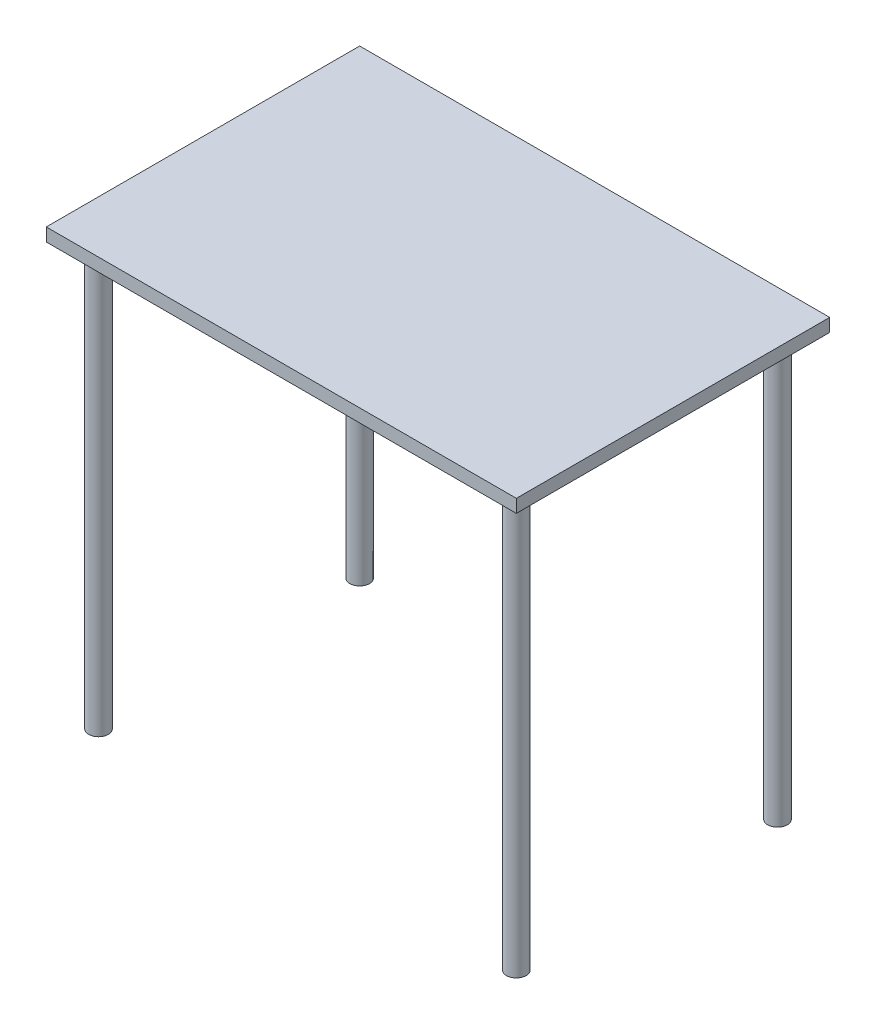
ISO-10303-21;
HEADER;
FILE_DESCRIPTION(('STEP AP214'),'2;1');
FILE_NAME('part.step','',(''),(''),'','','');
FILE_SCHEMA(('AUTOMOTIVE_DESIGN { 1 0 10303 214 1 1 1 1 }'));
ENDSEC;
DATA;
#1=APPLICATION_CONTEXT('core data for automotive mechanical design processes');
#2=APPLICATION_PROTOCOL_DEFINITION('international standard','automotive_design',2000,#1);
#3=PRODUCT_CONTEXT('',#1,'mechanical');
#4=PRODUCT('Part','Part','',(#3));
#5=PRODUCT_RELATED_PRODUCT_CATEGORY('part','',(#4));
#6=PRODUCT_DEFINITION_FORMATION('','',#4);
#7=PRODUCT_DEFINITION_CONTEXT('part definition',#1,'design');
#8=PRODUCT_DEFINITION('design','',#6,#7);
#9=PRODUCT_DEFINITION_SHAPE('','',#8);
#10=(LENGTH_UNIT() NAMED_UNIT(*) SI_UNIT(.MILLI.,.METRE.));
#11=(NAMED_UNIT(*) PLANE_ANGLE_UNIT() SI_UNIT($,.RADIAN.));
#12=(NAMED_UNIT(*) SI_UNIT($,.STERADIAN.) SOLID_ANGLE_UNIT());
#13=UNCERTAINTY_MEASURE_WITH_UNIT(LENGTH_MEASURE(1.E-05),#10,'distance_accuracy_value','');
#14=(GEOMETRIC_REPRESENTATION_CONTEXT(3) GLOBAL_UNCERTAINTY_ASSIGNED_CONTEXT((#13)) GLOBAL_UNIT_ASSIGNED_CONTEXT((#10,
#11,#12)) REPRESENTATION_CONTEXT('',''));
#15=CARTESIAN_POINT('',(0.,0.,0.));
#16=DIRECTION('',(0.,0.,1.));
#17=DIRECTION('',(1.,0.,0.));
#18=AXIS2_PLACEMENT_3D('',#15,#16,#17);
#19=CARTESIAN_POINT('',(0.,25.4,0.));
#20=DIRECTION('',(1.,0.,0.));
#21=DIRECTION('',(0.,0.,-1.));
#22=AXIS2_PLACEMENT_3D('',#19,#20,#21);
#23=PLANE('',#22);
#24=DIRECTION('',(0.,0.,1.));
#25=VECTOR('',#24,1.);
#26=CARTESIAN_POINT('',(0.,0.,0.));
#27=LINE('',#26,#25);
#28=CARTESIAN_POINT('',(0.,0.,-609.6));
#29=VERTEX_POINT('',#28);
#30=CARTESIAN_POINT('',(0.,0.,0.));
#31=VERTEX_POINT('',#30);
#32=EDGE_CURVE('E97',#29,#31,#27,.T.);
#33=ORIENTED_EDGE('',*,*,#32,.T.);
#34=DIRECTION('',(0.,-1.,0.));
#35=VECTOR('',#34,1.);
#36=CARTESIAN_POINT('',(0.,25.4,0.));
#37=LINE('',#36,#35);
#38=CARTESIAN_POINT('',(0.,25.4,0.));
#39=VERTEX_POINT('',#38);
#40=EDGE_CURVE('E12',#39,#31,#37,.T.);
#41=ORIENTED_EDGE('',*,*,#40,.F.);
#42=DIRECTION('',(0.,0.,1.));
#43=VECTOR('',#42,1.);
#44=CARTESIAN_POINT('',(0.,25.4,0.));
#45=LINE('',#44,#43);
#46=CARTESIAN_POINT('',(0.,25.4,-609.6));
#47=VERTEX_POINT('',#46);
#48=EDGE_CURVE('E85',#47,#39,#45,.T.);
#49=ORIENTED_EDGE('',*,*,#48,.F.);
#50=DIRECTION('',(0.,-1.,0.));
#51=VECTOR('',#50,1.);
#52=CARTESIAN_POINT('',(0.,25.4,-609.6));
#53=LINE('',#52,#51);
#54=EDGE_CURVE('E93',#47,#29,#53,.T.);
#55=ORIENTED_EDGE('',*,*,#54,.T.);
#56=EDGE_LOOP('',(#33,#41,#49,#55));
#57=FACE_BOUND('',#56,.T.);
#58=ADVANCED_FACE('F34',(#57),#23,.F.);
#59=CARTESIAN_POINT('',(0.,25.4,0.));
#60=DIRECTION('',(0.,0.,-1.));
#61=DIRECTION('',(-1.,0.,0.));
#62=AXIS2_PLACEMENT_3D('',#59,#60,#61);
#63=PLANE('',#62);
#64=DIRECTION('',(1.,0.,0.));
#65=VECTOR('',#64,1.);
#66=CARTESIAN_POINT('',(0.,0.,0.));
#67=LINE('',#66,#65);
#68=CARTESIAN_POINT('',(914.4,0.,0.));
#69=VERTEX_POINT('',#68);
#70=EDGE_CURVE('E89',#31,#69,#67,.T.);
#71=ORIENTED_EDGE('',*,*,#70,.T.);
#72=DIRECTION('',(0.,-1.,0.));
#73=VECTOR('',#72,1.);
#74=CARTESIAN_POINT('',(914.4,25.4,0.));
#75=LINE('',#74,#73);
#76=CARTESIAN_POINT('',(914.4,25.4,0.));
#77=VERTEX_POINT('',#76);
#78=EDGE_CURVE('E42',#77,#69,#75,.T.);
#79=ORIENTED_EDGE('',*,*,#78,.F.);
#80=DIRECTION('',(1.,0.,0.));
#81=VECTOR('',#80,1.);
#82=CARTESIAN_POINT('',(0.,25.4,0.));
#83=LINE('',#82,#81);
#84=EDGE_CURVE('E80',#39,#77,#83,.T.);
#85=ORIENTED_EDGE('',*,*,#84,.F.);
#86=ORIENTED_EDGE('',*,*,#40,.T.);
#87=EDGE_LOOP('',(#71,#79,#85,#86));
#88=FACE_BOUND('',#87,.T.);
#89=ADVANCED_FACE('F88',(#88),#63,.F.);
#90=CARTESIAN_POINT('',(914.4,25.4,0.));
#91=DIRECTION('',(-1.,0.,0.));
#92=DIRECTION('',(0.,0.,1.));
#93=AXIS2_PLACEMENT_3D('',#90,#91,#92);
#94=PLANE('',#93);
#95=DIRECTION('',(0.,0.,-1.));
#96=VECTOR('',#95,1.);
#97=CARTESIAN_POINT('',(914.4,0.,0.));
#98=LINE('',#97,#96);
#99=CARTESIAN_POINT('',(914.4,0.,-609.6));
#100=VERTEX_POINT('',#99);
#101=EDGE_CURVE('E67',#69,#100,#98,.T.);
#102=ORIENTED_EDGE('',*,*,#101,.T.);
#103=DIRECTION('',(0.,-1.,0.));
#104=VECTOR('',#103,1.);
#105=CARTESIAN_POINT('',(914.4,25.4,-609.6));
#106=LINE('',#105,#104);
#107=CARTESIAN_POINT('',(914.4,25.4,-609.6));
#108=VERTEX_POINT('',#107);
#109=EDGE_CURVE('E90',#108,#100,#106,.T.);
#110=ORIENTED_EDGE('',*,*,#109,.F.);
#111=DIRECTION('',(0.,0.,-1.));
#112=VECTOR('',#111,1.);
#113=CARTESIAN_POINT('',(914.4,25.4,0.));
#114=LINE('',#113,#112);
#115=EDGE_CURVE('E83',#77,#108,#114,.T.);
#116=ORIENTED_EDGE('',*,*,#115,.F.);
#117=ORIENTED_EDGE('',*,*,#78,.T.);
#118=EDGE_LOOP('',(#102,#110,#116,#117));
#119=FACE_BOUND('',#118,.T.);
#120=ADVANCED_FACE('F91',(#119),#94,.F.);
#121=CARTESIAN_POINT('',(0.,25.4,-609.6));
#122=DIRECTION('',(0.,0.,1.));
#123=DIRECTION('',(1.,0.,0.));
#124=AXIS2_PLACEMENT_3D('',#121,#122,#123);
#125=PLANE('',#124);
#126=DIRECTION('',(-1.,0.,0.));
#127=VECTOR('',#126,1.);
#128=CARTESIAN_POINT('',(0.,0.,-609.6));
#129=LINE('',#128,#127);
#130=EDGE_CURVE('E73',#100,#29,#129,.T.);
#131=ORIENTED_EDGE('',*,*,#130,.T.);
#132=ORIENTED_EDGE('',*,*,#54,.F.);
#133=DIRECTION('',(-1.,0.,0.));
#134=VECTOR('',#133,1.);
#135=CARTESIAN_POINT('',(0.,25.4,-609.6));
#136=LINE('',#135,#134);
#137=EDGE_CURVE('E50',#108,#47,#136,.T.);
#138=ORIENTED_EDGE('',*,*,#137,.F.);
#139=ORIENTED_EDGE('',*,*,#109,.T.);
#140=EDGE_LOOP('',(#131,#132,#138,#139));
#141=FACE_BOUND('',#140,.T.);
#142=ADVANCED_FACE('F105',(#141),#125,.F.);
#143=CARTESIAN_POINT('',(0.,25.4,0.));
#144=DIRECTION('',(0.,-1.,0.));
#145=DIRECTION('',(0.,0.,-1.));
#146=AXIS2_PLACEMENT_3D('',#143,#144,#145);
#147=PLANE('',#146);
#148=ORIENTED_EDGE('',*,*,#48,.T.);
#149=ORIENTED_EDGE('',*,*,#84,.T.);
#150=ORIENTED_EDGE('',*,*,#115,.T.);
#151=ORIENTED_EDGE('',*,*,#137,.T.);
#152=EDGE_LOOP('',(#148,#149,#150,#151));
#153=FACE_BOUND('',#152,.T.);
#154=ADVANCED_FACE('F81',(#153),#147,.F.);
#155=CARTESIAN_POINT('',(0.,0.,0.));
#156=DIRECTION('',(0.,-1.,0.));
#157=DIRECTION('',(0.,0.,-1.));
#158=AXIS2_PLACEMENT_3D('',#155,#156,#157);
#159=PLANE('',#158);
#160=CARTESIAN_POINT('',(863.6,0.,-558.8));
#161=DIRECTION('',(0.,-1.,0.));
#162=DIRECTION('',(0.,0.,-1.));
#163=AXIS2_PLACEMENT_3D('',#160,#161,#162);
#164=CIRCLE('',#163,19.05);
#165=CARTESIAN_POINT('',(863.6,0.,-577.85));
#166=VERTEX_POINT('',#165);
#167=EDGE_CURVE('E131',#166,#166,#164,.T.);
#168=ORIENTED_EDGE('',*,*,#167,.F.);
#169=EDGE_LOOP('',(#168));
#170=FACE_BOUND('',#169,.T.);
#171=CARTESIAN_POINT('',(50.8000000000001,0.,-558.8));
#172=DIRECTION('',(0.,-1.,0.));
#173=DIRECTION('',(0.,0.,-1.));
#174=AXIS2_PLACEMENT_3D('',#171,#172,#173);
#175=CIRCLE('',#174,19.05);
#176=CARTESIAN_POINT('',(50.8000000000001,0.,-577.85));
#177=VERTEX_POINT('',#176);
#178=EDGE_CURVE('E125',#177,#177,#175,.T.);
#179=ORIENTED_EDGE('',*,*,#178,.F.);
#180=EDGE_LOOP('',(#179));
#181=FACE_BOUND('',#180,.T.);
#182=CARTESIAN_POINT('',(863.6,0.,-50.7999999999999));
#183=DIRECTION('',(0.,-1.,0.));
#184=DIRECTION('',(0.,0.,-1.));
#185=AXIS2_PLACEMENT_3D('',#182,#183,#184);
#186=CIRCLE('',#185,19.05);
#187=CARTESIAN_POINT('',(863.6,0.,-69.8499999999999));
#188=VERTEX_POINT('',#187);
#189=EDGE_CURVE('E119',#188,#188,#186,.T.);
#190=ORIENTED_EDGE('',*,*,#189,.F.);
#191=EDGE_LOOP('',(#190));
#192=FACE_BOUND('',#191,.T.);
#193=CARTESIAN_POINT('',(50.8,0.,-50.8));
#194=DIRECTION('',(0.,-1.,0.));
#195=DIRECTION('',(0.,0.,-1.));
#196=AXIS2_PLACEMENT_3D('',#193,#194,#195);
#197=CIRCLE('',#196,19.0500000000001);
#198=CARTESIAN_POINT('',(50.8,0.,-69.8500000000001));
#199=VERTEX_POINT('',#198);
#200=EDGE_CURVE('E113',#199,#199,#197,.T.);
#201=ORIENTED_EDGE('',*,*,#200,.F.);
#202=EDGE_LOOP('',(#201));
#203=FACE_BOUND('',#202,.T.);
#204=ORIENTED_EDGE('',*,*,#32,.F.);
#205=ORIENTED_EDGE('',*,*,#130,.F.);
#206=ORIENTED_EDGE('',*,*,#101,.F.);
#207=ORIENTED_EDGE('',*,*,#70,.F.);
#208=EDGE_LOOP('',(#204,#205,#206,#207));
#209=FACE_BOUND('',#208,.T.);
#210=ADVANCED_FACE('F108',(#170,#181,#192,#203,#209),#159,.T.);
#211=CARTESIAN_POINT('',(50.8,-1719.41033672642,-50.8));
#212=DIRECTION('',(0.,1.,0.));
#213=DIRECTION('',(0.,0.,1.));
#214=AXIS2_PLACEMENT_3D('',#211,#212,#213);
#215=CYLINDRICAL_SURFACE('',#214,19.0500000000001);
#216=ORIENTED_EDGE('',*,*,#200,.T.);
#217=EDGE_LOOP('',(#216));
#218=FACE_BOUND('',#217,.T.);
#219=CARTESIAN_POINT('',(50.8,-820.0644,-50.8));
#220=DIRECTION('',(0.,-1.,0.));
#221=DIRECTION('',(0.,0.,-1.));
#222=AXIS2_PLACEMENT_3D('',#219,#220,#221);
#223=CIRCLE('',#222,19.0500000000001);
#224=CARTESIAN_POINT('',(50.8,-820.0644,-69.8500000000001));
#225=VERTEX_POINT('',#224);
#226=EDGE_CURVE('E100',#225,#225,#223,.T.);
#227=ORIENTED_EDGE('',*,*,#226,.F.);
#228=EDGE_LOOP('',(#227));
#229=FACE_BOUND('',#228,.T.);
#230=ADVANCED_FACE('F140',(#218,#229),#215,.T.);
#231=CARTESIAN_POINT('',(0.,-820.0644,0.));
#232=DIRECTION('',(0.,-1.,0.));
#233=DIRECTION('',(0.,0.,-1.));
#234=AXIS2_PLACEMENT_3D('',#231,#232,#233);
#235=PLANE('',#234);
#236=ORIENTED_EDGE('',*,*,#226,.T.);
#237=EDGE_LOOP('',(#236));
#238=FACE_BOUND('',#237,.T.);
#239=ADVANCED_FACE('F150',(#238),#235,.T.);
#240=CARTESIAN_POINT('',(863.6,-1719.41033672642,-50.7999999999999));
#241=DIRECTION('',(0.,1.,0.));
#242=DIRECTION('',(0.,0.,1.));
#243=AXIS2_PLACEMENT_3D('',#240,#241,#242);
#244=CYLINDRICAL_SURFACE('',#243,19.05);
#245=ORIENTED_EDGE('',*,*,#189,.T.);
#246=EDGE_LOOP('',(#245));
#247=FACE_BOUND('',#246,.T.);
#248=CARTESIAN_POINT('',(863.6,-820.0644,-50.7999999999999));
#249=DIRECTION('',(0.,-1.,0.));
#250=DIRECTION('',(0.,0.,-1.));
#251=AXIS2_PLACEMENT_3D('',#248,#249,#250);
#252=CIRCLE('',#251,19.05);
#253=CARTESIAN_POINT('',(863.6,-820.0644,-69.8499999999999));
#254=VERTEX_POINT('',#253);
#255=EDGE_CURVE('E116',#254,#254,#252,.T.);
#256=ORIENTED_EDGE('',*,*,#255,.F.);
#257=EDGE_LOOP('',(#256));
#258=FACE_BOUND('',#257,.T.);
#259=ADVANCED_FACE('F155',(#247,#258),#244,.T.);
#260=CARTESIAN_POINT('',(0.,-820.0644,0.));
#261=DIRECTION('',(0.,-1.,0.));
#262=DIRECTION('',(0.,0.,-1.));
#263=AXIS2_PLACEMENT_3D('',#260,#261,#262);
#264=PLANE('',#263);
#265=ORIENTED_EDGE('',*,*,#255,.T.);
#266=EDGE_LOOP('',(#265));
#267=FACE_BOUND('',#266,.T.);
#268=ADVANCED_FACE('F160',(#267),#264,.T.);
#269=CARTESIAN_POINT('',(50.8000000000001,-1719.41033672642,-558.8));
#270=DIRECTION('',(0.,1.,0.));
#271=DIRECTION('',(0.,0.,1.));
#272=AXIS2_PLACEMENT_3D('',#269,#270,#271);
#273=CYLINDRICAL_SURFACE('',#272,19.05);
#274=ORIENTED_EDGE('',*,*,#178,.T.);
#275=EDGE_LOOP('',(#274));
#276=FACE_BOUND('',#275,.T.);
#277=CARTESIAN_POINT('',(50.8000000000001,-820.0644,-558.8));
#278=DIRECTION('',(0.,-1.,0.));
#279=DIRECTION('',(0.,0.,-1.));
#280=AXIS2_PLACEMENT_3D('',#277,#278,#279);
#281=CIRCLE('',#280,19.05);
#282=CARTESIAN_POINT('',(50.8000000000001,-820.0644,-577.85));
#283=VERTEX_POINT('',#282);
#284=EDGE_CURVE('E122',#283,#283,#281,.T.);
#285=ORIENTED_EDGE('',*,*,#284,.F.);
#286=EDGE_LOOP('',(#285));
#287=FACE_BOUND('',#286,.T.);
#288=ADVANCED_FACE('F206',(#276,#287),#273,.T.);
#289=CARTESIAN_POINT('',(0.,-820.0644,0.));
#290=DIRECTION('',(0.,-1.,0.));
#291=DIRECTION('',(0.,0.,-1.));
#292=AXIS2_PLACEMENT_3D('',#289,#290,#291);
#293=PLANE('',#292);
#294=ORIENTED_EDGE('',*,*,#284,.T.);
#295=EDGE_LOOP('',(#294));
#296=FACE_BOUND('',#295,.T.);
#297=ADVANCED_FACE('F216',(#296),#293,.T.);
#298=CARTESIAN_POINT('',(863.6,-1719.41033672642,-558.8));
#299=DIRECTION('',(0.,1.,0.));
#300=DIRECTION('',(0.,0.,1.));
#301=AXIS2_PLACEMENT_3D('',#298,#299,#300);
#302=CYLINDRICAL_SURFACE('',#301,19.05);
#303=ORIENTED_EDGE('',*,*,#167,.T.);
#304=EDGE_LOOP('',(#303));
#305=FACE_BOUND('',#304,.T.);
#306=CARTESIAN_POINT('',(863.6,-820.0644,-558.8));
#307=DIRECTION('',(0.,-1.,0.));
#308=DIRECTION('',(0.,0.,-1.));
#309=AXIS2_PLACEMENT_3D('',#306,#307,#308);
#310=CIRCLE('',#309,19.05);
#311=CARTESIAN_POINT('',(863.6,-820.0644,-577.85));
#312=VERTEX_POINT('',#311);
#313=EDGE_CURVE('E128',#312,#312,#310,.T.);
#314=ORIENTED_EDGE('',*,*,#313,.F.);
#315=EDGE_LOOP('',(#314));
#316=FACE_BOUND('',#315,.T.);
#317=ADVANCED_FACE('F135',(#305,#316),#302,.T.);
#318=CARTESIAN_POINT('',(0.,-820.0644,0.));
#319=DIRECTION('',(0.,-1.,0.));
#320=DIRECTION('',(0.,0.,-1.));
#321=AXIS2_PLACEMENT_3D('',#318,#319,#320);
#322=PLANE('',#321);
#323=ORIENTED_EDGE('',*,*,#313,.T.);
#324=EDGE_LOOP('',(#323));
#325=FACE_BOUND('',#324,.T.);
#326=ADVANCED_FACE('F235',(#325),#322,.T.);
#327=CLOSED_SHELL('',(#58,#89,#120,#142,#154,#210,#230,#239,#259,#268,#288,#297,#317,#326));
#328=MANIFOLD_SOLID_BREP('B2',#327);
#329=ADVANCED_BREP_SHAPE_REPRESENTATION('',(#18,#328),#14);
#330=SHAPE_DEFINITION_REPRESENTATION(#9,#329);
ENDSEC;
END-ISO-10303-21;
